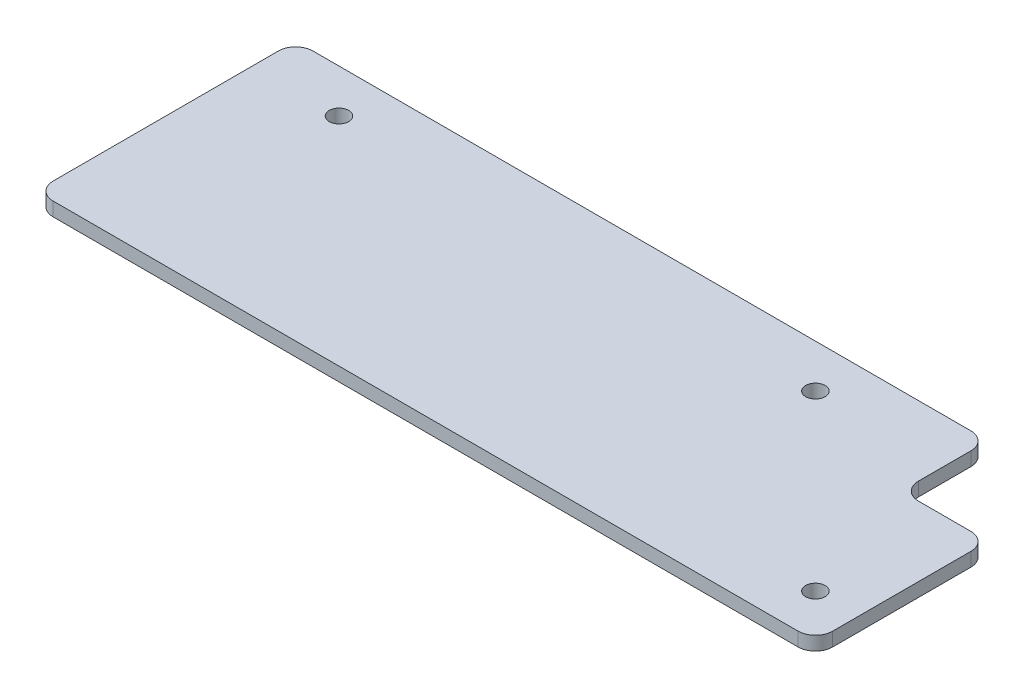
ISO-10303-21;
HEADER;
FILE_DESCRIPTION(('STEP AP214'),'2;1');
FILE_NAME('part.step','',(''),(''),'','','');
FILE_SCHEMA(('AUTOMOTIVE_DESIGN { 1 0 10303 214 1 1 1 1 }'));
ENDSEC;
DATA;
#1=APPLICATION_CONTEXT('core data for automotive mechanical design processes');
#2=APPLICATION_PROTOCOL_DEFINITION('international standard','automotive_design',2000,#1);
#3=PRODUCT_CONTEXT('',#1,'mechanical');
#4=PRODUCT('Part','Part','',(#3));
#5=PRODUCT_RELATED_PRODUCT_CATEGORY('part','',(#4));
#6=PRODUCT_DEFINITION_FORMATION('','',#4);
#7=PRODUCT_DEFINITION_CONTEXT('part definition',#1,'design');
#8=PRODUCT_DEFINITION('design','',#6,#7);
#9=PRODUCT_DEFINITION_SHAPE('','',#8);
#10=(LENGTH_UNIT() NAMED_UNIT(*) SI_UNIT(.MILLI.,.METRE.));
#11=(NAMED_UNIT(*) PLANE_ANGLE_UNIT() SI_UNIT($,.RADIAN.));
#12=(NAMED_UNIT(*) SI_UNIT($,.STERADIAN.) SOLID_ANGLE_UNIT());
#13=UNCERTAINTY_MEASURE_WITH_UNIT(LENGTH_MEASURE(1.E-05),#10,'distance_accuracy_value','');
#14=(GEOMETRIC_REPRESENTATION_CONTEXT(3) GLOBAL_UNCERTAINTY_ASSIGNED_CONTEXT((#13)) GLOBAL_UNIT_ASSIGNED_CONTEXT((#10,
#11,#12)) REPRESENTATION_CONTEXT('',''));
#15=CARTESIAN_POINT('',(0.,0.,0.));
#16=DIRECTION('',(0.,0.,1.));
#17=DIRECTION('',(1.,0.,0.));
#18=AXIS2_PLACEMENT_3D('',#15,#16,#17);
#19=CARTESIAN_POINT('',(-90.,3.175,30.));
#20=DIRECTION('',(1.,0.,0.));
#21=DIRECTION('',(0.,0.,-1.));
#22=AXIS2_PLACEMENT_3D('',#19,#20,#21);
#23=PLANE('',#22);
#24=DIRECTION('',(0.,0.,1.));
#25=VECTOR('',#24,1.);
#26=CARTESIAN_POINT('',(-90.,3.175,30.));
#27=LINE('',#26,#25);
#28=CARTESIAN_POINT('',(-90.,3.175,-26.));
#29=VERTEX_POINT('',#28);
#30=CARTESIAN_POINT('',(-90.,3.175,26.));
#31=VERTEX_POINT('',#30);
#32=EDGE_CURVE('E159',#29,#31,#27,.T.);
#33=ORIENTED_EDGE('',*,*,#32,.F.);
#34=DIRECTION('',(0.,-1.,0.));
#35=VECTOR('',#34,1.);
#36=CARTESIAN_POINT('',(-90.,3.175,-26.));
#37=LINE('',#36,#35);
#38=CARTESIAN_POINT('',(-90.,0.,-26.));
#39=VERTEX_POINT('',#38);
#40=EDGE_CURVE('E213',#29,#39,#37,.T.);
#41=ORIENTED_EDGE('',*,*,#40,.T.);
#42=DIRECTION('',(0.,0.,1.));
#43=VECTOR('',#42,1.);
#44=CARTESIAN_POINT('',(-90.,0.,30.));
#45=LINE('',#44,#43);
#46=CARTESIAN_POINT('',(-90.,0.,26.));
#47=VERTEX_POINT('',#46);
#48=EDGE_CURVE('E149',#39,#47,#45,.T.);
#49=ORIENTED_EDGE('',*,*,#48,.T.);
#50=DIRECTION('',(0.,-1.,0.));
#51=VECTOR('',#50,1.);
#52=CARTESIAN_POINT('',(-90.,3.175,26.));
#53=LINE('',#52,#51);
#54=EDGE_CURVE('E211',#47,#31,#53,.F.);
#55=ORIENTED_EDGE('',*,*,#54,.T.);
#56=EDGE_LOOP('',(#33,#41,#49,#55));
#57=FACE_BOUND('',#56,.T.);
#58=ADVANCED_FACE('F33',(#57),#23,.F.);
#59=CARTESIAN_POINT('',(90.,3.175,30.));
#60=DIRECTION('',(0.,0.,-1.));
#61=DIRECTION('',(-1.,0.,0.));
#62=AXIS2_PLACEMENT_3D('',#59,#60,#61);
#63=PLANE('',#62);
#64=DIRECTION('',(1.,0.,0.));
#65=VECTOR('',#64,1.);
#66=CARTESIAN_POINT('',(90.,0.,30.));
#67=LINE('',#66,#65);
#68=CARTESIAN_POINT('',(-85.9999999999999,0.,30.));
#69=VERTEX_POINT('',#68);
#70=CARTESIAN_POINT('',(86.,0.,30.));
#71=VERTEX_POINT('',#70);
#72=EDGE_CURVE('E152',#69,#71,#67,.T.);
#73=ORIENTED_EDGE('',*,*,#72,.T.);
#74=DIRECTION('',(0.,-1.,0.));
#75=VECTOR('',#74,1.);
#76=CARTESIAN_POINT('',(86.,3.175,30.));
#77=LINE('',#76,#75);
#78=CARTESIAN_POINT('',(86.,3.175,30.));
#79=VERTEX_POINT('',#78);
#80=EDGE_CURVE('E209',#71,#79,#77,.F.);
#81=ORIENTED_EDGE('',*,*,#80,.T.);
#82=DIRECTION('',(1.,0.,0.));
#83=VECTOR('',#82,1.);
#84=CARTESIAN_POINT('',(90.,3.175,30.));
#85=LINE('',#84,#83);
#86=CARTESIAN_POINT('',(-85.9999999999999,3.175,30.));
#87=VERTEX_POINT('',#86);
#88=EDGE_CURVE('E162',#87,#79,#85,.T.);
#89=ORIENTED_EDGE('',*,*,#88,.F.);
#90=DIRECTION('',(0.,-1.,0.));
#91=VECTOR('',#90,1.);
#92=CARTESIAN_POINT('',(-86.,3.175,30.));
#93=LINE('',#92,#91);
#94=EDGE_CURVE('E206',#87,#69,#93,.T.);
#95=ORIENTED_EDGE('',*,*,#94,.T.);
#96=EDGE_LOOP('',(#73,#81,#89,#95));
#97=FACE_BOUND('',#96,.T.);
#98=ADVANCED_FACE('F228',(#97),#63,.F.);
#99=CARTESIAN_POINT('',(90.,3.175,30.));
#100=DIRECTION('',(-1.,0.,0.));
#101=DIRECTION('',(0.,0.,1.));
#102=AXIS2_PLACEMENT_3D('',#99,#100,#101);
#103=PLANE('',#102);
#104=DIRECTION('',(0.,0.,-1.));
#105=VECTOR('',#104,1.);
#106=CARTESIAN_POINT('',(90.,0.,30.));
#107=LINE('',#106,#105);
#108=CARTESIAN_POINT('',(90.,0.,26.));
#109=VERTEX_POINT('',#108);
#110=CARTESIAN_POINT('',(90.,0.,-5.90000000000001));
#111=VERTEX_POINT('',#110);
#112=EDGE_CURVE('E173',#109,#111,#107,.T.);
#113=ORIENTED_EDGE('',*,*,#112,.T.);
#114=DIRECTION('',(0.,1.,0.));
#115=VECTOR('',#114,1.);
#116=CARTESIAN_POINT('',(90.,3.175,-5.90000000000001));
#117=LINE('',#116,#115);
#118=CARTESIAN_POINT('',(90.,3.175,-5.90000000000001));
#119=VERTEX_POINT('',#118);
#120=EDGE_CURVE('E203',#111,#119,#117,.T.);
#121=ORIENTED_EDGE('',*,*,#120,.T.);
#122=DIRECTION('',(0.,0.,-1.));
#123=VECTOR('',#122,1.);
#124=CARTESIAN_POINT('',(90.,3.175,30.));
#125=LINE('',#124,#123);
#126=CARTESIAN_POINT('',(90.,3.175,26.));
#127=VERTEX_POINT('',#126);
#128=EDGE_CURVE('E166',#127,#119,#125,.T.);
#129=ORIENTED_EDGE('',*,*,#128,.F.);
#130=DIRECTION('',(0.,-1.,0.));
#131=VECTOR('',#130,1.);
#132=CARTESIAN_POINT('',(90.,3.175,26.));
#133=LINE('',#132,#131);
#134=EDGE_CURVE('E200',#127,#109,#133,.T.);
#135=ORIENTED_EDGE('',*,*,#134,.T.);
#136=EDGE_LOOP('',(#113,#121,#129,#135));
#137=FACE_BOUND('',#136,.T.);
#138=ADVANCED_FACE('F237',(#137),#103,.F.);
#139=CARTESIAN_POINT('',(90.,3.175,-30.));
#140=DIRECTION('',(0.,0.,1.));
#141=DIRECTION('',(1.,0.,0.));
#142=AXIS2_PLACEMENT_3D('',#139,#140,#141);
#143=PLANE('',#142);
#144=DIRECTION('',(-1.,0.,0.));
#145=VECTOR('',#144,1.);
#146=CARTESIAN_POINT('',(90.,3.175,-30.));
#147=LINE('',#146,#145);
#148=CARTESIAN_POINT('',(65.9,3.175,-30.));
#149=VERTEX_POINT('',#148);
#150=CARTESIAN_POINT('',(-85.9999999999999,3.175,-30.));
#151=VERTEX_POINT('',#150);
#152=EDGE_CURVE('E169',#149,#151,#147,.T.);
#153=ORIENTED_EDGE('',*,*,#152,.F.);
#154=DIRECTION('',(0.,1.,0.));
#155=VECTOR('',#154,1.);
#156=CARTESIAN_POINT('',(65.9,3.175,-30.));
#157=LINE('',#156,#155);
#158=CARTESIAN_POINT('',(65.9,0.,-30.));
#159=VERTEX_POINT('',#158);
#160=EDGE_CURVE('E128',#149,#159,#157,.F.);
#161=ORIENTED_EDGE('',*,*,#160,.T.);
#162=DIRECTION('',(-1.,0.,0.));
#163=VECTOR('',#162,1.);
#164=CARTESIAN_POINT('',(90.,0.,-30.));
#165=LINE('',#164,#163);
#166=CARTESIAN_POINT('',(-85.9999999999999,0.,-30.));
#167=VERTEX_POINT('',#166);
#168=EDGE_CURVE('E163',#159,#167,#165,.T.);
#169=ORIENTED_EDGE('',*,*,#168,.T.);
#170=DIRECTION('',(0.,-1.,0.));
#171=VECTOR('',#170,1.);
#172=CARTESIAN_POINT('',(-86.,3.175,-30.));
#173=LINE('',#172,#171);
#174=EDGE_CURVE('E133',#167,#151,#173,.F.);
#175=ORIENTED_EDGE('',*,*,#174,.T.);
#176=EDGE_LOOP('',(#153,#161,#169,#175));
#177=FACE_BOUND('',#176,.T.);
#178=ADVANCED_FACE('F221',(#177),#143,.F.);
#179=CARTESIAN_POINT('',(0.,3.175,0.));
#180=DIRECTION('',(0.,1.,0.));
#181=DIRECTION('',(0.,0.,1.));
#182=AXIS2_PLACEMENT_3D('',#179,#180,#181);
#183=PLANE('',#182);
#184=CARTESIAN_POINT('',(-70.,3.175,-20.));
#185=DIRECTION('',(0.,1.,0.));
#186=DIRECTION('',(0.,0.,1.));
#187=AXIS2_PLACEMENT_3D('',#184,#185,#186);
#188=CIRCLE('',#187,2.24999999999999);
#189=CARTESIAN_POINT('',(-70.,3.175,-17.75));
#190=VERTEX_POINT('',#189);
#191=EDGE_CURVE('E266',#190,#190,#188,.T.);
#192=ORIENTED_EDGE('',*,*,#191,.F.);
#193=EDGE_LOOP('',(#192));
#194=FACE_BOUND('',#193,.T.);
#195=CARTESIAN_POINT('',(40.,3.175,-20.));
#196=DIRECTION('',(0.,1.,0.));
#197=DIRECTION('',(0.,0.,1.));
#198=AXIS2_PLACEMENT_3D('',#195,#196,#197);
#199=CIRCLE('',#198,2.24999999999999);
#200=CARTESIAN_POINT('',(40.,3.175,-17.75));
#201=VERTEX_POINT('',#200);
#202=EDGE_CURVE('E260',#201,#201,#199,.T.);
#203=ORIENTED_EDGE('',*,*,#202,.F.);
#204=EDGE_LOOP('',(#203));
#205=FACE_BOUND('',#204,.T.);
#206=CARTESIAN_POINT('',(80.,3.175,20.));
#207=DIRECTION('',(0.,1.,0.));
#208=DIRECTION('',(0.,0.,1.));
#209=AXIS2_PLACEMENT_3D('',#206,#207,#208);
#210=CIRCLE('',#209,2.24999999999999);
#211=CARTESIAN_POINT('',(80.,3.175,22.25));
#212=VERTEX_POINT('',#211);
#213=EDGE_CURVE('E254',#212,#212,#210,.T.);
#214=ORIENTED_EDGE('',*,*,#213,.F.);
#215=EDGE_LOOP('',(#214));
#216=FACE_BOUND('',#215,.T.);
#217=DIRECTION('',(0.,0.,1.));
#218=VECTOR('',#217,1.);
#219=CARTESIAN_POINT('',(69.9,3.175,0.));
#220=LINE('',#219,#218);
#221=CARTESIAN_POINT('',(69.9,3.175,-26.));
#222=VERTEX_POINT('',#221);
#223=CARTESIAN_POINT('',(69.9,3.175,-13.9));
#224=VERTEX_POINT('',#223);
#225=EDGE_CURVE('E140',#222,#224,#220,.T.);
#226=ORIENTED_EDGE('',*,*,#225,.F.);
#227=CARTESIAN_POINT('',(65.9,3.175,-26.));
#228=DIRECTION('',(0.,1.,0.));
#229=DIRECTION('',(0.,0.,1.));
#230=AXIS2_PLACEMENT_3D('',#227,#228,#229);
#231=CIRCLE('',#230,4.);
#232=EDGE_CURVE('E123',#222,#149,#231,.T.);
#233=ORIENTED_EDGE('',*,*,#232,.T.);
#234=ORIENTED_EDGE('',*,*,#152,.T.);
#235=CARTESIAN_POINT('',(-86.,3.175,-26.));
#236=DIRECTION('',(0.,1.,0.));
#237=DIRECTION('',(0.,0.,1.));
#238=AXIS2_PLACEMENT_3D('',#235,#236,#237);
#239=CIRCLE('',#238,4.);
#240=EDGE_CURVE('E180',#151,#29,#239,.T.);
#241=ORIENTED_EDGE('',*,*,#240,.T.);
#242=ORIENTED_EDGE('',*,*,#32,.T.);
#243=CARTESIAN_POINT('',(-86.,3.175,26.));
#244=DIRECTION('',(0.,1.,0.));
#245=DIRECTION('',(0.,0.,1.));
#246=AXIS2_PLACEMENT_3D('',#243,#244,#245);
#247=CIRCLE('',#246,4.);
#248=EDGE_CURVE('E144',#31,#87,#247,.T.);
#249=ORIENTED_EDGE('',*,*,#248,.T.);
#250=ORIENTED_EDGE('',*,*,#88,.T.);
#251=CARTESIAN_POINT('',(86.,3.175,26.));
#252=DIRECTION('',(0.,1.,0.));
#253=DIRECTION('',(0.,0.,1.));
#254=AXIS2_PLACEMENT_3D('',#251,#252,#253);
#255=CIRCLE('',#254,4.);
#256=EDGE_CURVE('E182',#79,#127,#255,.T.);
#257=ORIENTED_EDGE('',*,*,#256,.T.);
#258=ORIENTED_EDGE('',*,*,#128,.T.);
#259=CARTESIAN_POINT('',(86.,3.175,-5.90000000000001));
#260=DIRECTION('',(0.,1.,0.));
#261=DIRECTION('',(0.,0.,1.));
#262=AXIS2_PLACEMENT_3D('',#259,#260,#261);
#263=CIRCLE('',#262,4.);
#264=CARTESIAN_POINT('',(86.,3.175,-9.90000000000001));
#265=VERTEX_POINT('',#264);
#266=EDGE_CURVE('E134',#119,#265,#263,.T.);
#267=ORIENTED_EDGE('',*,*,#266,.T.);
#268=DIRECTION('',(1.,0.,0.));
#269=VECTOR('',#268,1.);
#270=CARTESIAN_POINT('',(0.,3.175,-9.90000000000001));
#271=LINE('',#270,#269);
#272=CARTESIAN_POINT('',(73.9,3.175,-9.90000000000001));
#273=VERTEX_POINT('',#272);
#274=EDGE_CURVE('E150',#273,#265,#271,.T.);
#275=ORIENTED_EDGE('',*,*,#274,.F.);
#276=CARTESIAN_POINT('',(73.9,3.175,-13.9));
#277=DIRECTION('',(0.,1.,0.));
#278=DIRECTION('',(0.,0.,1.));
#279=AXIS2_PLACEMENT_3D('',#276,#277,#278);
#280=CIRCLE('',#279,4.);
#281=EDGE_CURVE('E41',#273,#224,#280,.F.);
#282=ORIENTED_EDGE('',*,*,#281,.T.);
#283=EDGE_LOOP('',(#226,#233,#234,#241,#242,#249,#250,#257,#258,#267,#275,#282));
#284=FACE_BOUND('',#283,.T.);
#285=ADVANCED_FACE('F147',(#194,#205,#216,#284),#183,.T.);
#286=CARTESIAN_POINT('',(0.,0.,0.));
#287=DIRECTION('',(0.,1.,0.));
#288=DIRECTION('',(0.,0.,1.));
#289=AXIS2_PLACEMENT_3D('',#286,#287,#288);
#290=PLANE('',#289);
#291=CARTESIAN_POINT('',(-70.,0.,-20.));
#292=DIRECTION('',(0.,1.,0.));
#293=DIRECTION('',(0.,0.,1.));
#294=AXIS2_PLACEMENT_3D('',#291,#292,#293);
#295=CIRCLE('',#294,2.25);
#296=CARTESIAN_POINT('',(-70.,0.,-17.75));
#297=VERTEX_POINT('',#296);
#298=EDGE_CURVE('E263',#297,#297,#295,.T.);
#299=ORIENTED_EDGE('',*,*,#298,.T.);
#300=EDGE_LOOP('',(#299));
#301=FACE_BOUND('',#300,.T.);
#302=CARTESIAN_POINT('',(40.,0.,-20.));
#303=DIRECTION('',(0.,1.,0.));
#304=DIRECTION('',(0.,0.,1.));
#305=AXIS2_PLACEMENT_3D('',#302,#303,#304);
#306=CIRCLE('',#305,2.25);
#307=CARTESIAN_POINT('',(40.,0.,-17.75));
#308=VERTEX_POINT('',#307);
#309=EDGE_CURVE('E257',#308,#308,#306,.T.);
#310=ORIENTED_EDGE('',*,*,#309,.T.);
#311=EDGE_LOOP('',(#310));
#312=FACE_BOUND('',#311,.T.);
#313=CARTESIAN_POINT('',(80.,0.,20.));
#314=DIRECTION('',(0.,1.,0.));
#315=DIRECTION('',(0.,0.,1.));
#316=AXIS2_PLACEMENT_3D('',#313,#314,#315);
#317=CIRCLE('',#316,2.25);
#318=CARTESIAN_POINT('',(80.,0.,22.25));
#319=VERTEX_POINT('',#318);
#320=EDGE_CURVE('E249',#319,#319,#317,.T.);
#321=ORIENTED_EDGE('',*,*,#320,.T.);
#322=EDGE_LOOP('',(#321));
#323=FACE_BOUND('',#322,.T.);
#324=ORIENTED_EDGE('',*,*,#168,.F.);
#325=CARTESIAN_POINT('',(65.9,0.,-26.));
#326=DIRECTION('',(0.,1.,0.));
#327=DIRECTION('',(0.,0.,1.));
#328=AXIS2_PLACEMENT_3D('',#325,#326,#327);
#329=CIRCLE('',#328,4.);
#330=CARTESIAN_POINT('',(69.9,0.,-26.));
#331=VERTEX_POINT('',#330);
#332=EDGE_CURVE('E193',#159,#331,#329,.F.);
#333=ORIENTED_EDGE('',*,*,#332,.T.);
#334=DIRECTION('',(0.,0.,1.));
#335=VECTOR('',#334,1.);
#336=CARTESIAN_POINT('',(69.9,0.,-30.));
#337=LINE('',#336,#335);
#338=CARTESIAN_POINT('',(69.9,0.,-13.9));
#339=VERTEX_POINT('',#338);
#340=EDGE_CURVE('E143',#331,#339,#337,.T.);
#341=ORIENTED_EDGE('',*,*,#340,.T.);
#342=CARTESIAN_POINT('',(73.9,0.,-13.9));
#343=DIRECTION('',(0.,1.,0.));
#344=DIRECTION('',(0.,0.,1.));
#345=AXIS2_PLACEMENT_3D('',#342,#343,#344);
#346=CIRCLE('',#345,4.);
#347=CARTESIAN_POINT('',(73.9,0.,-9.90000000000001));
#348=VERTEX_POINT('',#347);
#349=EDGE_CURVE('E11',#339,#348,#346,.T.);
#350=ORIENTED_EDGE('',*,*,#349,.T.);
#351=DIRECTION('',(1.,0.,0.));
#352=VECTOR('',#351,1.);
#353=CARTESIAN_POINT('',(69.9,0.,-9.90000000000001));
#354=LINE('',#353,#352);
#355=CARTESIAN_POINT('',(86.,0.,-9.90000000000001));
#356=VERTEX_POINT('',#355);
#357=EDGE_CURVE('E155',#348,#356,#354,.T.);
#358=ORIENTED_EDGE('',*,*,#357,.T.);
#359=CARTESIAN_POINT('',(86.,0.,-5.90000000000001));
#360=DIRECTION('',(0.,1.,0.));
#361=DIRECTION('',(0.,0.,1.));
#362=AXIS2_PLACEMENT_3D('',#359,#360,#361);
#363=CIRCLE('',#362,4.);
#364=EDGE_CURVE('E191',#356,#111,#363,.F.);
#365=ORIENTED_EDGE('',*,*,#364,.T.);
#366=ORIENTED_EDGE('',*,*,#112,.F.);
#367=CARTESIAN_POINT('',(86.,0.,26.));
#368=DIRECTION('',(0.,1.,0.));
#369=DIRECTION('',(0.,0.,1.));
#370=AXIS2_PLACEMENT_3D('',#367,#368,#369);
#371=CIRCLE('',#370,4.);
#372=EDGE_CURVE('E189',#109,#71,#371,.F.);
#373=ORIENTED_EDGE('',*,*,#372,.T.);
#374=ORIENTED_EDGE('',*,*,#72,.F.);
#375=CARTESIAN_POINT('',(-86.,0.,26.));
#376=DIRECTION('',(0.,1.,0.));
#377=DIRECTION('',(0.,0.,1.));
#378=AXIS2_PLACEMENT_3D('',#375,#376,#377);
#379=CIRCLE('',#378,4.);
#380=EDGE_CURVE('E48',#69,#47,#379,.F.);
#381=ORIENTED_EDGE('',*,*,#380,.T.);
#382=ORIENTED_EDGE('',*,*,#48,.F.);
#383=CARTESIAN_POINT('',(-86.,0.,-26.));
#384=DIRECTION('',(0.,1.,0.));
#385=DIRECTION('',(0.,0.,1.));
#386=AXIS2_PLACEMENT_3D('',#383,#384,#385);
#387=CIRCLE('',#386,4.);
#388=EDGE_CURVE('E56',#39,#167,#387,.F.);
#389=ORIENTED_EDGE('',*,*,#388,.T.);
#390=EDGE_LOOP('',(#324,#333,#341,#350,#358,#365,#366,#373,#374,#381,#382,#389));
#391=FACE_BOUND('',#390,.T.);
#392=ADVANCED_FACE('F219',(#301,#312,#323,#391),#290,.F.);
#393=CARTESIAN_POINT('',(69.9,0.,-30.));
#394=DIRECTION('',(-1.,0.,0.));
#395=DIRECTION('',(0.,0.,1.));
#396=AXIS2_PLACEMENT_3D('',#393,#394,#395);
#397=PLANE('',#396);
#398=ORIENTED_EDGE('',*,*,#340,.F.);
#399=DIRECTION('',(0.,1.,0.));
#400=VECTOR('',#399,1.);
#401=CARTESIAN_POINT('',(69.9,0.,-26.));
#402=LINE('',#401,#400);
#403=EDGE_CURVE('E127',#331,#222,#402,.T.);
#404=ORIENTED_EDGE('',*,*,#403,.T.);
#405=ORIENTED_EDGE('',*,*,#225,.T.);
#406=DIRECTION('',(0.,1.,0.));
#407=VECTOR('',#406,1.);
#408=CARTESIAN_POINT('',(69.9,0.,-13.9));
#409=LINE('',#408,#407);
#410=EDGE_CURVE('E145',#224,#339,#409,.F.);
#411=ORIENTED_EDGE('',*,*,#410,.T.);
#412=EDGE_LOOP('',(#398,#404,#405,#411));
#413=FACE_BOUND('',#412,.T.);
#414=ADVANCED_FACE('F139',(#413),#397,.F.);
#415=CARTESIAN_POINT('',(69.9,0.,-9.90000000000001));
#416=DIRECTION('',(0.,0.,1.));
#417=DIRECTION('',(1.,0.,0.));
#418=AXIS2_PLACEMENT_3D('',#415,#416,#417);
#419=PLANE('',#418);
#420=ORIENTED_EDGE('',*,*,#357,.F.);
#421=DIRECTION('',(0.,1.,0.));
#422=VECTOR('',#421,1.);
#423=CARTESIAN_POINT('',(73.9,3.175,-9.90000000000001));
#424=LINE('',#423,#422);
#425=EDGE_CURVE('E197',#348,#273,#424,.T.);
#426=ORIENTED_EDGE('',*,*,#425,.T.);
#427=ORIENTED_EDGE('',*,*,#274,.T.);
#428=DIRECTION('',(0.,1.,0.));
#429=VECTOR('',#428,1.);
#430=CARTESIAN_POINT('',(86.,0.,-9.90000000000001));
#431=LINE('',#430,#429);
#432=EDGE_CURVE('E195',#265,#356,#431,.F.);
#433=ORIENTED_EDGE('',*,*,#432,.T.);
#434=EDGE_LOOP('',(#420,#426,#427,#433));
#435=FACE_BOUND('',#434,.T.);
#436=ADVANCED_FACE('F243',(#435),#419,.F.);
#437=CARTESIAN_POINT('',(80.,3.175,20.));
#438=DIRECTION('',(0.,1.,0.));
#439=DIRECTION('',(0.,0.,1.));
#440=AXIS2_PLACEMENT_3D('',#437,#438,#439);
#441=CYLINDRICAL_SURFACE('',#440,2.25);
#442=ORIENTED_EDGE('',*,*,#320,.F.);
#443=EDGE_LOOP('',(#442));
#444=FACE_BOUND('',#443,.T.);
#445=ORIENTED_EDGE('',*,*,#213,.T.);
#446=EDGE_LOOP('',(#445));
#447=FACE_BOUND('',#446,.T.);
#448=ADVANCED_FACE('F279',(#444,#447),#441,.F.);
#449=CARTESIAN_POINT('',(40.,3.175,-20.));
#450=DIRECTION('',(0.,1.,0.));
#451=DIRECTION('',(0.,0.,1.));
#452=AXIS2_PLACEMENT_3D('',#449,#450,#451);
#453=CYLINDRICAL_SURFACE('',#452,2.25);
#454=ORIENTED_EDGE('',*,*,#309,.F.);
#455=EDGE_LOOP('',(#454));
#456=FACE_BOUND('',#455,.T.);
#457=ORIENTED_EDGE('',*,*,#202,.T.);
#458=EDGE_LOOP('',(#457));
#459=FACE_BOUND('',#458,.T.);
#460=ADVANCED_FACE('F281',(#456,#459),#453,.F.);
#461=CARTESIAN_POINT('',(-70.,3.175,-20.));
#462=DIRECTION('',(0.,1.,0.));
#463=DIRECTION('',(0.,0.,1.));
#464=AXIS2_PLACEMENT_3D('',#461,#462,#463);
#465=CYLINDRICAL_SURFACE('',#464,2.25);
#466=ORIENTED_EDGE('',*,*,#298,.F.);
#467=EDGE_LOOP('',(#466));
#468=FACE_BOUND('',#467,.T.);
#469=ORIENTED_EDGE('',*,*,#191,.T.);
#470=EDGE_LOOP('',(#469));
#471=FACE_BOUND('',#470,.T.);
#472=ADVANCED_FACE('F270',(#468,#471),#465,.F.);
#473=CARTESIAN_POINT('',(65.9,0.,-26.));
#474=DIRECTION('',(0.,1.,0.));
#475=DIRECTION('',(0.,0.,1.));
#476=AXIS2_PLACEMENT_3D('',#473,#474,#475);
#477=CYLINDRICAL_SURFACE('',#476,4.);
#478=ORIENTED_EDGE('',*,*,#332,.F.);
#479=ORIENTED_EDGE('',*,*,#160,.F.);
#480=ORIENTED_EDGE('',*,*,#232,.F.);
#481=ORIENTED_EDGE('',*,*,#403,.F.);
#482=EDGE_LOOP('',(#478,#479,#480,#481));
#483=FACE_BOUND('',#482,.T.);
#484=ADVANCED_FACE('F126',(#483),#477,.T.);
#485=CARTESIAN_POINT('',(73.9,0.,-13.9));
#486=DIRECTION('',(0.,-1.,0.));
#487=DIRECTION('',(0.,0.,-1.));
#488=AXIS2_PLACEMENT_3D('',#485,#486,#487);
#489=CYLINDRICAL_SURFACE('',#488,4.);
#490=ORIENTED_EDGE('',*,*,#349,.F.);
#491=ORIENTED_EDGE('',*,*,#410,.F.);
#492=ORIENTED_EDGE('',*,*,#281,.F.);
#493=ORIENTED_EDGE('',*,*,#425,.F.);
#494=EDGE_LOOP('',(#490,#491,#492,#493));
#495=FACE_BOUND('',#494,.T.);
#496=ADVANCED_FACE('F302',(#495),#489,.F.);
#497=CARTESIAN_POINT('',(86.,3.175,-5.90000000000001));
#498=DIRECTION('',(0.,1.,0.));
#499=DIRECTION('',(0.,0.,1.));
#500=AXIS2_PLACEMENT_3D('',#497,#498,#499);
#501=CYLINDRICAL_SURFACE('',#500,4.);
#502=ORIENTED_EDGE('',*,*,#364,.F.);
#503=ORIENTED_EDGE('',*,*,#432,.F.);
#504=ORIENTED_EDGE('',*,*,#266,.F.);
#505=ORIENTED_EDGE('',*,*,#120,.F.);
#506=EDGE_LOOP('',(#502,#503,#504,#505));
#507=FACE_BOUND('',#506,.T.);
#508=ADVANCED_FACE('F247',(#507),#501,.T.);
#509=CARTESIAN_POINT('',(86.,3.175,26.));
#510=DIRECTION('',(0.,-1.,0.));
#511=DIRECTION('',(0.,0.,-1.));
#512=AXIS2_PLACEMENT_3D('',#509,#510,#511);
#513=CYLINDRICAL_SURFACE('',#512,4.);
#514=ORIENTED_EDGE('',*,*,#256,.F.);
#515=ORIENTED_EDGE('',*,*,#80,.F.);
#516=ORIENTED_EDGE('',*,*,#372,.F.);
#517=ORIENTED_EDGE('',*,*,#134,.F.);
#518=EDGE_LOOP('',(#514,#515,#516,#517));
#519=FACE_BOUND('',#518,.T.);
#520=ADVANCED_FACE('F234',(#519),#513,.T.);
#521=CARTESIAN_POINT('',(-86.,3.175,-26.));
#522=DIRECTION('',(0.,-1.,0.));
#523=DIRECTION('',(0.,0.,-1.));
#524=AXIS2_PLACEMENT_3D('',#521,#522,#523);
#525=CYLINDRICAL_SURFACE('',#524,4.);
#526=ORIENTED_EDGE('',*,*,#240,.F.);
#527=ORIENTED_EDGE('',*,*,#174,.F.);
#528=ORIENTED_EDGE('',*,*,#388,.F.);
#529=ORIENTED_EDGE('',*,*,#40,.F.);
#530=EDGE_LOOP('',(#526,#527,#528,#529));
#531=FACE_BOUND('',#530,.T.);
#532=ADVANCED_FACE('F222',(#531),#525,.T.);
#533=CARTESIAN_POINT('',(-86.,3.175,26.));
#534=DIRECTION('',(0.,-1.,0.));
#535=DIRECTION('',(0.,0.,-1.));
#536=AXIS2_PLACEMENT_3D('',#533,#534,#535);
#537=CYLINDRICAL_SURFACE('',#536,4.);
#538=ORIENTED_EDGE('',*,*,#248,.F.);
#539=ORIENTED_EDGE('',*,*,#54,.F.);
#540=ORIENTED_EDGE('',*,*,#380,.F.);
#541=ORIENTED_EDGE('',*,*,#94,.F.);
#542=EDGE_LOOP('',(#538,#539,#540,#541));
#543=FACE_BOUND('',#542,.T.);
#544=ADVANCED_FACE('F35',(#543),#537,.T.);
#545=CLOSED_SHELL('',(#58,#98,#138,#178,#285,#392,#414,#436,#448,#460,#472,#484,#496,#508,#520,
#532,#544));
#546=MANIFOLD_SOLID_BREP('B2',#545);
#547=ADVANCED_BREP_SHAPE_REPRESENTATION('',(#18,#546),#14);
#548=SHAPE_DEFINITION_REPRESENTATION(#9,#547);
ENDSEC;
END-ISO-10303-21;
